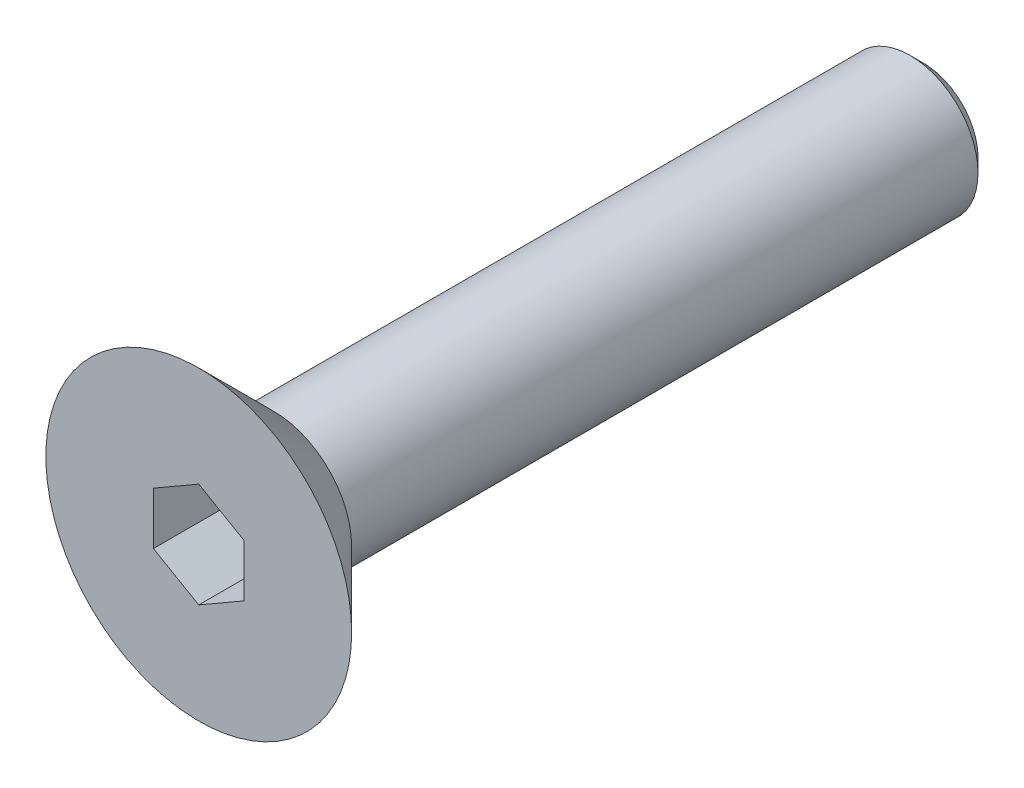
ISO-10303-21;
HEADER;
FILE_DESCRIPTION(('STEP AP214'),'2;1');
FILE_NAME('part.step','',(''),(''),'','','');
FILE_SCHEMA(('AUTOMOTIVE_DESIGN { 1 0 10303 214 1 1 1 1 }'));
ENDSEC;
DATA;
#1=APPLICATION_CONTEXT('core data for automotive mechanical design processes');
#2=APPLICATION_PROTOCOL_DEFINITION('international standard','automotive_design',2000,#1);
#3=PRODUCT_CONTEXT('',#1,'mechanical');
#4=PRODUCT('Part','Part','',(#3));
#5=PRODUCT_RELATED_PRODUCT_CATEGORY('part','',(#4));
#6=PRODUCT_DEFINITION_FORMATION('','',#4);
#7=PRODUCT_DEFINITION_CONTEXT('part definition',#1,'design');
#8=PRODUCT_DEFINITION('design','',#6,#7);
#9=PRODUCT_DEFINITION_SHAPE('','',#8);
#10=(LENGTH_UNIT() NAMED_UNIT(*) SI_UNIT(.MILLI.,.METRE.));
#11=(NAMED_UNIT(*) PLANE_ANGLE_UNIT() SI_UNIT($,.RADIAN.));
#12=(NAMED_UNIT(*) SI_UNIT($,.STERADIAN.) SOLID_ANGLE_UNIT());
#13=UNCERTAINTY_MEASURE_WITH_UNIT(LENGTH_MEASURE(1.E-05),#10,'distance_accuracy_value','');
#14=(GEOMETRIC_REPRESENTATION_CONTEXT(3) GLOBAL_UNCERTAINTY_ASSIGNED_CONTEXT((#13)) GLOBAL_UNIT_ASSIGNED_CONTEXT((#10,
#11,#12)) REPRESENTATION_CONTEXT('',''));
#15=CARTESIAN_POINT('',(0.,0.,0.));
#16=DIRECTION('',(0.,0.,1.));
#17=DIRECTION('',(1.,0.,0.));
#18=AXIS2_PLACEMENT_3D('',#15,#16,#17);
#19=CARTESIAN_POINT('',(0.,0.,0.));
#20=DIRECTION('',(0.,0.,1.));
#21=DIRECTION('',(1.,0.,0.));
#22=AXIS2_PLACEMENT_3D('',#19,#20,#21);
#23=PLANE('',#22);
#24=CARTESIAN_POINT('',(0.,0.,0.));
#25=DIRECTION('',(0.,0.,1.));
#26=DIRECTION('',(1.,0.,0.));
#27=AXIS2_PLACEMENT_3D('',#24,#25,#26);
#28=CIRCLE('',#27,1.725);
#29=CARTESIAN_POINT('',(1.725,0.,0.));
#30=VERTEX_POINT('',#29);
#31=EDGE_CURVE('E11',#30,#30,#28,.F.);
#32=ORIENTED_EDGE('',*,*,#31,.T.);
#33=EDGE_LOOP('',(#32));
#34=FACE_BOUND('',#33,.T.);
#35=CARTESIAN_POINT('',(0.,0.,0.));
#36=DIRECTION('',(0.,0.,1.));
#37=DIRECTION('',(1.,0.,0.));
#38=AXIS2_PLACEMENT_3D('',#35,#36,#37);
#39=CIRCLE('',#38,1.5);
#40=CARTESIAN_POINT('',(1.5,0.,0.));
#41=VERTEX_POINT('',#40);
#42=EDGE_CURVE('E144',#41,#41,#39,.F.);
#43=ORIENTED_EDGE('',*,*,#42,.F.);
#44=EDGE_LOOP('',(#43));
#45=FACE_BOUND('',#44,.T.);
#46=ADVANCED_FACE('F34',(#34,#45),#23,.F.);
#47=CARTESIAN_POINT('',(0.,0.,1.65));
#48=DIRECTION('',(0.,0.,1.));
#49=DIRECTION('',(1.,0.,0.));
#50=AXIS2_PLACEMENT_3D('',#47,#48,#49);
#51=PLANE('',#50);
#52=DIRECTION('',(-0.866025403784439,0.5,0.));
#53=VECTOR('',#52,1.);
#54=CARTESIAN_POINT('',(1.,0.577350269189626,1.65));
#55=LINE('',#54,#53);
#56=CARTESIAN_POINT('',(1.,0.577350269189626,1.65));
#57=VERTEX_POINT('',#56);
#58=CARTESIAN_POINT('',(0.,1.15470053837925,1.65));
#59=VERTEX_POINT('',#58);
#60=EDGE_CURVE('E49',#57,#59,#55,.T.);
#61=ORIENTED_EDGE('',*,*,#60,.F.);
#62=DIRECTION('',(0.,1.,0.));
#63=VECTOR('',#62,1.);
#64=CARTESIAN_POINT('',(1.,-0.577350269189626,1.65));
#65=LINE('',#64,#63);
#66=CARTESIAN_POINT('',(1.,-0.577350269189626,1.65));
#67=VERTEX_POINT('',#66);
#68=EDGE_CURVE('E132',#67,#57,#65,.T.);
#69=ORIENTED_EDGE('',*,*,#68,.F.);
#70=DIRECTION('',(0.866025403784439,0.5,0.));
#71=VECTOR('',#70,1.);
#72=CARTESIAN_POINT('',(0.,-1.15470053837925,1.65));
#73=LINE('',#72,#71);
#74=CARTESIAN_POINT('',(0.,-1.15470053837925,1.65));
#75=VERTEX_POINT('',#74);
#76=EDGE_CURVE('E130',#75,#67,#73,.T.);
#77=ORIENTED_EDGE('',*,*,#76,.F.);
#78=DIRECTION('',(0.866025403784439,-0.5,0.));
#79=VECTOR('',#78,1.);
#80=CARTESIAN_POINT('',(-1.,-0.577350269189626,1.65));
#81=LINE('',#80,#79);
#82=CARTESIAN_POINT('',(-1.,-0.577350269189626,1.65));
#83=VERTEX_POINT('',#82);
#84=EDGE_CURVE('E97',#83,#75,#81,.T.);
#85=ORIENTED_EDGE('',*,*,#84,.F.);
#86=DIRECTION('',(0.,-1.,0.));
#87=VECTOR('',#86,1.);
#88=CARTESIAN_POINT('',(-1.,0.577350269189626,1.65));
#89=LINE('',#88,#87);
#90=CARTESIAN_POINT('',(-1.,0.577350269189626,1.65));
#91=VERTEX_POINT('',#90);
#92=EDGE_CURVE('E126',#91,#83,#89,.T.);
#93=ORIENTED_EDGE('',*,*,#92,.F.);
#94=DIRECTION('',(-0.866025403784439,-0.5,0.));
#95=VECTOR('',#94,1.);
#96=CARTESIAN_POINT('',(0.,1.15470053837925,1.65));
#97=LINE('',#96,#95);
#98=EDGE_CURVE('E123',#59,#91,#97,.T.);
#99=ORIENTED_EDGE('',*,*,#98,.F.);
#100=EDGE_LOOP('',(#61,#69,#77,#85,#93,#99));
#101=FACE_BOUND('',#100,.T.);
#102=CARTESIAN_POINT('',(0.,0.,1.65));
#103=DIRECTION('',(0.,0.,1.));
#104=DIRECTION('',(1.,0.,0.));
#105=AXIS2_PLACEMENT_3D('',#102,#103,#104);
#106=CIRCLE('',#105,3.375);
#107=CARTESIAN_POINT('',(3.37500000000001,0.,1.65));
#108=VERTEX_POINT('',#107);
#109=EDGE_CURVE('E136',#108,#108,#106,.T.);
#110=ORIENTED_EDGE('',*,*,#109,.T.);
#111=EDGE_LOOP('',(#110));
#112=FACE_BOUND('',#111,.T.);
#113=ADVANCED_FACE('F167',(#101,#112),#51,.T.);
#114=CARTESIAN_POINT('',(0.,0.,-14.35));
#115=DIRECTION('',(0.,0.,1.));
#116=DIRECTION('',(1.,0.,0.));
#117=AXIS2_PLACEMENT_3D('',#114,#115,#116);
#118=CYLINDRICAL_SURFACE('',#117,1.5);
#119=CARTESIAN_POINT('',(0.,0.,-14.05));
#120=DIRECTION('',(0.,0.,-1.));
#121=DIRECTION('',(-1.,0.,0.));
#122=AXIS2_PLACEMENT_3D('',#119,#120,#121);
#123=CIRCLE('',#122,1.5);
#124=CARTESIAN_POINT('',(-1.5,0.,-14.05));
#125=VERTEX_POINT('',#124);
#126=EDGE_CURVE('E42',#125,#125,#123,.F.);
#127=ORIENTED_EDGE('',*,*,#126,.T.);
#128=EDGE_LOOP('',(#127));
#129=FACE_BOUND('',#128,.T.);
#130=ORIENTED_EDGE('',*,*,#42,.T.);
#131=EDGE_LOOP('',(#130));
#132=FACE_BOUND('',#131,.T.);
#133=ADVANCED_FACE('F152',(#129,#132),#118,.T.);
#134=CARTESIAN_POINT('',(0.,0.,-14.35));
#135=DIRECTION('',(0.,0.,-1.));
#136=DIRECTION('',(-1.,0.,0.));
#137=AXIS2_PLACEMENT_3D('',#134,#135,#136);
#138=PLANE('',#137);
#139=CARTESIAN_POINT('',(0.,0.,-14.35));
#140=DIRECTION('',(0.,0.,-1.));
#141=DIRECTION('',(-1.,0.,0.));
#142=AXIS2_PLACEMENT_3D('',#139,#140,#141);
#143=CIRCLE('',#142,1.2);
#144=CARTESIAN_POINT('',(-1.2,0.,-14.35));
#145=VERTEX_POINT('',#144);
#146=EDGE_CURVE('E147',#145,#145,#143,.T.);
#147=ORIENTED_EDGE('',*,*,#146,.T.);
#148=EDGE_LOOP('',(#147));
#149=FACE_BOUND('',#148,.T.);
#150=ADVANCED_FACE('F159',(#149),#138,.T.);
#151=CARTESIAN_POINT('',(0.,0.,-14.35));
#152=DIRECTION('',(0.,0.,1.));
#153=DIRECTION('',(1.,0.,0.));
#154=AXIS2_PLACEMENT_3D('',#151,#152,#153);
#155=CONICAL_SURFACE('',#154,1.2,0.785398163397444);
#156=ORIENTED_EDGE('',*,*,#126,.F.);
#157=EDGE_LOOP('',(#156));
#158=FACE_BOUND('',#157,.T.);
#159=ORIENTED_EDGE('',*,*,#146,.F.);
#160=EDGE_LOOP('',(#159));
#161=FACE_BOUND('',#160,.T.);
#162=ADVANCED_FACE('F155',(#158,#161),#155,.T.);
#163=CARTESIAN_POINT('',(1.,0.577350269189626,-0.35));
#164=DIRECTION('',(0.5,0.866025403784439,0.));
#165=DIRECTION('',(-0.866025403784439,0.5,0.));
#166=AXIS2_PLACEMENT_3D('',#163,#164,#165);
#167=PLANE('',#166);
#168=ORIENTED_EDGE('',*,*,#60,.T.);
#169=DIRECTION('',(0.,0.,1.));
#170=VECTOR('',#169,1.);
#171=CARTESIAN_POINT('',(0.,1.15470053837925,-0.35));
#172=LINE('',#171,#170);
#173=CARTESIAN_POINT('',(0.,1.15470053837925,-0.35));
#174=VERTEX_POINT('',#173);
#175=EDGE_CURVE('E79',#174,#59,#172,.T.);
#176=ORIENTED_EDGE('',*,*,#175,.F.);
#177=DIRECTION('',(-0.866025403784439,0.5,0.));
#178=VECTOR('',#177,1.);
#179=CARTESIAN_POINT('',(1.,0.577350269189626,-0.35));
#180=LINE('',#179,#178);
#181=CARTESIAN_POINT('',(1.,0.577350269189626,-0.35));
#182=VERTEX_POINT('',#181);
#183=EDGE_CURVE('E134',#182,#174,#180,.T.);
#184=ORIENTED_EDGE('',*,*,#183,.F.);
#185=DIRECTION('',(0.,0.,1.));
#186=VECTOR('',#185,1.);
#187=CARTESIAN_POINT('',(1.,0.577350269189626,-0.35));
#188=LINE('',#187,#186);
#189=EDGE_CURVE('E57',#182,#57,#188,.T.);
#190=ORIENTED_EDGE('',*,*,#189,.T.);
#191=EDGE_LOOP('',(#168,#176,#184,#190));
#192=FACE_BOUND('',#191,.T.);
#193=ADVANCED_FACE('F158',(#192),#167,.F.);
#194=CARTESIAN_POINT('',(1.,-0.577350269189626,-0.35));
#195=DIRECTION('',(1.,0.,0.));
#196=DIRECTION('',(0.,1.,0.));
#197=AXIS2_PLACEMENT_3D('',#194,#195,#196);
#198=PLANE('',#197);
#199=ORIENTED_EDGE('',*,*,#68,.T.);
#200=ORIENTED_EDGE('',*,*,#189,.F.);
#201=DIRECTION('',(0.,1.,0.));
#202=VECTOR('',#201,1.);
#203=CARTESIAN_POINT('',(1.,-0.577350269189626,-0.35));
#204=LINE('',#203,#202);
#205=CARTESIAN_POINT('',(1.,-0.577350269189626,-0.35));
#206=VERTEX_POINT('',#205);
#207=EDGE_CURVE('E109',#206,#182,#204,.T.);
#208=ORIENTED_EDGE('',*,*,#207,.F.);
#209=DIRECTION('',(0.,0.,1.));
#210=VECTOR('',#209,1.);
#211=CARTESIAN_POINT('',(1.,-0.577350269189626,-0.35));
#212=LINE('',#211,#210);
#213=EDGE_CURVE('E101',#206,#67,#212,.T.);
#214=ORIENTED_EDGE('',*,*,#213,.T.);
#215=EDGE_LOOP('',(#199,#200,#208,#214));
#216=FACE_BOUND('',#215,.T.);
#217=ADVANCED_FACE('F198',(#216),#198,.F.);
#218=CARTESIAN_POINT('',(0.,-1.15470053837925,-0.35));
#219=DIRECTION('',(0.5,-0.866025403784439,0.));
#220=DIRECTION('',(0.866025403784439,0.5,0.));
#221=AXIS2_PLACEMENT_3D('',#218,#219,#220);
#222=PLANE('',#221);
#223=ORIENTED_EDGE('',*,*,#76,.T.);
#224=ORIENTED_EDGE('',*,*,#213,.F.);
#225=DIRECTION('',(0.866025403784439,0.5,0.));
#226=VECTOR('',#225,1.);
#227=CARTESIAN_POINT('',(0.,-1.15470053837925,-0.35));
#228=LINE('',#227,#226);
#229=CARTESIAN_POINT('',(0.,-1.15470053837925,-0.35));
#230=VERTEX_POINT('',#229);
#231=EDGE_CURVE('E105',#230,#206,#228,.T.);
#232=ORIENTED_EDGE('',*,*,#231,.F.);
#233=DIRECTION('',(0.,0.,1.));
#234=VECTOR('',#233,1.);
#235=CARTESIAN_POINT('',(0.,-1.15470053837925,-0.35));
#236=LINE('',#235,#234);
#237=EDGE_CURVE('E90',#230,#75,#236,.T.);
#238=ORIENTED_EDGE('',*,*,#237,.T.);
#239=EDGE_LOOP('',(#223,#224,#232,#238));
#240=FACE_BOUND('',#239,.T.);
#241=ADVANCED_FACE('F106',(#240),#222,.F.);
#242=CARTESIAN_POINT('',(-1.,-0.577350269189626,-0.35));
#243=DIRECTION('',(-0.5,-0.866025403784439,0.));
#244=DIRECTION('',(0.866025403784439,-0.5,0.));
#245=AXIS2_PLACEMENT_3D('',#242,#243,#244);
#246=PLANE('',#245);
#247=ORIENTED_EDGE('',*,*,#84,.T.);
#248=ORIENTED_EDGE('',*,*,#237,.F.);
#249=DIRECTION('',(0.866025403784439,-0.5,0.));
#250=VECTOR('',#249,1.);
#251=CARTESIAN_POINT('',(-1.,-0.577350269189626,-0.35));
#252=LINE('',#251,#250);
#253=CARTESIAN_POINT('',(-1.,-0.577350269189626,-0.35));
#254=VERTEX_POINT('',#253);
#255=EDGE_CURVE('E94',#254,#230,#252,.T.);
#256=ORIENTED_EDGE('',*,*,#255,.F.);
#257=DIRECTION('',(0.,0.,1.));
#258=VECTOR('',#257,1.);
#259=CARTESIAN_POINT('',(-1.,-0.577350269189626,-0.35));
#260=LINE('',#259,#258);
#261=EDGE_CURVE('E102',#254,#83,#260,.T.);
#262=ORIENTED_EDGE('',*,*,#261,.T.);
#263=EDGE_LOOP('',(#247,#248,#256,#262));
#264=FACE_BOUND('',#263,.T.);
#265=ADVANCED_FACE('F92',(#264),#246,.F.);
#266=CARTESIAN_POINT('',(-1.,0.577350269189626,-0.35));
#267=DIRECTION('',(-1.,0.,0.));
#268=DIRECTION('',(0.,-1.,0.));
#269=AXIS2_PLACEMENT_3D('',#266,#267,#268);
#270=PLANE('',#269);
#271=ORIENTED_EDGE('',*,*,#92,.T.);
#272=ORIENTED_EDGE('',*,*,#261,.F.);
#273=DIRECTION('',(0.,-1.,0.));
#274=VECTOR('',#273,1.);
#275=CARTESIAN_POINT('',(-1.,0.577350269189626,-0.35));
#276=LINE('',#275,#274);
#277=CARTESIAN_POINT('',(-1.,0.577350269189626,-0.35));
#278=VERTEX_POINT('',#277);
#279=EDGE_CURVE('E115',#278,#254,#276,.T.);
#280=ORIENTED_EDGE('',*,*,#279,.F.);
#281=DIRECTION('',(0.,0.,1.));
#282=VECTOR('',#281,1.);
#283=CARTESIAN_POINT('',(-1.,0.577350269189626,-0.35));
#284=LINE('',#283,#282);
#285=EDGE_CURVE('E139',#278,#91,#284,.T.);
#286=ORIENTED_EDGE('',*,*,#285,.T.);
#287=EDGE_LOOP('',(#271,#272,#280,#286));
#288=FACE_BOUND('',#287,.T.);
#289=ADVANCED_FACE('F194',(#288),#270,.F.);
#290=CARTESIAN_POINT('',(0.,1.15470053837925,-0.35));
#291=DIRECTION('',(-0.5,0.866025403784439,0.));
#292=DIRECTION('',(-0.866025403784439,-0.5,0.));
#293=AXIS2_PLACEMENT_3D('',#290,#291,#292);
#294=PLANE('',#293);
#295=ORIENTED_EDGE('',*,*,#98,.T.);
#296=ORIENTED_EDGE('',*,*,#285,.F.);
#297=DIRECTION('',(-0.866025403784439,-0.5,0.));
#298=VECTOR('',#297,1.);
#299=CARTESIAN_POINT('',(0.,1.15470053837925,-0.35));
#300=LINE('',#299,#298);
#301=EDGE_CURVE('E117',#174,#278,#300,.T.);
#302=ORIENTED_EDGE('',*,*,#301,.F.);
#303=ORIENTED_EDGE('',*,*,#175,.T.);
#304=EDGE_LOOP('',(#295,#296,#302,#303));
#305=FACE_BOUND('',#304,.T.);
#306=ADVANCED_FACE('F189',(#305),#294,.F.);
#307=CARTESIAN_POINT('',(0.,0.,-0.35));
#308=DIRECTION('',(0.,0.,1.));
#309=DIRECTION('',(1.,0.,0.));
#310=AXIS2_PLACEMENT_3D('',#307,#308,#309);
#311=PLANE('',#310);
#312=ORIENTED_EDGE('',*,*,#183,.T.);
#313=ORIENTED_EDGE('',*,*,#301,.T.);
#314=ORIENTED_EDGE('',*,*,#279,.T.);
#315=ORIENTED_EDGE('',*,*,#255,.T.);
#316=ORIENTED_EDGE('',*,*,#231,.T.);
#317=ORIENTED_EDGE('',*,*,#207,.T.);
#318=EDGE_LOOP('',(#312,#313,#314,#315,#316,#317));
#319=FACE_BOUND('',#318,.T.);
#320=ADVANCED_FACE('F112',(#319),#311,.T.);
#321=CARTESIAN_POINT('',(0.,0.,1.64999999999999));
#322=DIRECTION('',(0.,0.,1.));
#323=DIRECTION('',(1.,0.,0.));
#324=AXIS2_PLACEMENT_3D('',#321,#322,#323);
#325=CONICAL_SURFACE('',#324,3.375,0.78539816339745);
#326=CARTESIAN_POINT('',(1.725,0.,0.));
#327=CARTESIAN_POINT('',(1.7421875,0.,0.0171874999999997));
#328=CARTESIAN_POINT('',(1.759375,0.,0.0343749999999997));
#329=CARTESIAN_POINT('',(1.79375,0.,0.0687499999999997));
#330=CARTESIAN_POINT('',(1.8109375,0.,0.0859374999999997));
#331=CARTESIAN_POINT('',(1.8453125,0.,0.1203125));
#332=CARTESIAN_POINT('',(1.8625,0.,0.1375));
#333=CARTESIAN_POINT('',(1.896875,0.,0.171875));
#334=CARTESIAN_POINT('',(1.9140625,0.,0.1890625));
#335=CARTESIAN_POINT('',(1.9484375,0.,0.2234375));
#336=CARTESIAN_POINT('',(1.965625,0.,0.240625));
#337=CARTESIAN_POINT('',(2.,0.,0.275));
#338=CARTESIAN_POINT('',(2.0171875,0.,0.2921875));
#339=CARTESIAN_POINT('',(2.0515625,0.,0.3265625));
#340=CARTESIAN_POINT('',(2.06875,0.,0.34375));
#341=CARTESIAN_POINT('',(2.103125,0.,0.378125));
#342=CARTESIAN_POINT('',(2.1203125,0.,0.3953125));
#343=CARTESIAN_POINT('',(2.1546875,0.,0.4296875));
#344=CARTESIAN_POINT('',(2.171875,0.,0.446875));
#345=CARTESIAN_POINT('',(2.20625,0.,0.48125));
#346=CARTESIAN_POINT('',(2.2234375,0.,0.4984375));
#347=CARTESIAN_POINT('',(2.2578125,0.,0.5328125));
#348=CARTESIAN_POINT('',(2.275,0.,0.55));
#349=CARTESIAN_POINT('',(2.309375,0.,0.584375));
#350=CARTESIAN_POINT('',(2.3265625,0.,0.6015625));
#351=CARTESIAN_POINT('',(2.3609375,0.,0.6359375));
#352=CARTESIAN_POINT('',(2.378125,0.,0.653125));
#353=CARTESIAN_POINT('',(2.4125,0.,0.6875));
#354=CARTESIAN_POINT('',(2.4296875,0.,0.7046875));
#355=CARTESIAN_POINT('',(2.4640625,0.,0.7390625));
#356=CARTESIAN_POINT('',(2.48125,0.,0.75625));
#357=CARTESIAN_POINT('',(2.515625,0.,0.790625));
#358=CARTESIAN_POINT('',(2.5328125,0.,0.8078125));
#359=CARTESIAN_POINT('',(2.5671875,0.,0.8421875));
#360=CARTESIAN_POINT('',(2.584375,0.,0.859375));
#361=CARTESIAN_POINT('',(2.61875,0.,0.89375));
#362=CARTESIAN_POINT('',(2.6359375,0.,0.9109375));
#363=CARTESIAN_POINT('',(2.6703125,0.,0.9453125));
#364=CARTESIAN_POINT('',(2.6875,0.,0.9625));
#365=CARTESIAN_POINT('',(2.721875,0.,0.996875));
#366=CARTESIAN_POINT('',(2.7390625,0.,1.0140625));
#367=CARTESIAN_POINT('',(2.7734375,0.,1.0484375));
#368=CARTESIAN_POINT('',(2.790625,0.,1.065625));
#369=CARTESIAN_POINT('',(2.825,0.,1.1));
#370=CARTESIAN_POINT('',(2.8421875,0.,1.1171875));
#371=CARTESIAN_POINT('',(2.8765625,0.,1.1515625));
#372=CARTESIAN_POINT('',(2.89375,0.,1.16875));
#373=CARTESIAN_POINT('',(2.928125,0.,1.203125));
#374=CARTESIAN_POINT('',(2.9453125,0.,1.2203125));
#375=CARTESIAN_POINT('',(2.9796875,0.,1.2546875));
#376=CARTESIAN_POINT('',(2.996875,0.,1.271875));
#377=CARTESIAN_POINT('',(3.03125,0.,1.30625));
#378=CARTESIAN_POINT('',(3.0484375,0.,1.3234375));
#379=CARTESIAN_POINT('',(3.0828125,0.,1.3578125));
#380=CARTESIAN_POINT('',(3.1,0.,1.375));
#381=CARTESIAN_POINT('',(3.134375,0.,1.409375));
#382=CARTESIAN_POINT('',(3.1515625,0.,1.4265625));
#383=CARTESIAN_POINT('',(3.1859375,0.,1.4609375));
#384=CARTESIAN_POINT('',(3.203125,0.,1.478125));
#385=CARTESIAN_POINT('',(3.2375,0.,1.5125));
#386=CARTESIAN_POINT('',(3.2546875,0.,1.5296875));
#387=CARTESIAN_POINT('',(3.2890625,0.,1.5640625));
#388=CARTESIAN_POINT('',(3.30625,0.,1.58125));
#389=CARTESIAN_POINT('',(3.34062500000001,0.,1.615625));
#390=CARTESIAN_POINT('',(3.3578125,0.,1.6328125));
#391=CARTESIAN_POINT('',(3.37500000000001,0.,1.65));
#392=B_SPLINE_CURVE_WITH_KNOTS('',3,(#326,#327,#328,#329,#330,#331,#332,#333,#334,#335,#336,
#337,#338,#339,#340,#341,#342,#343,#344,#345,#346,#347,#348,#349,#350,#351,#352,#353,#354,#355,
#356,#357,#358,#359,#360,#361,#362,#363,#364,#365,#366,#367,#368,#369,#370,#371,#372,#373,#374,
#375,#376,#377,#378,#379,#380,#381,#382,#383,#384,#385,#386,#387,#388,#389,#390,#391),
.UNSPECIFIED.,.F.,.F.,(4,2,2,2,2,2,2,2,2,2,2,2,2,2,2,2,2,2,2,2,2,2,2,2,2,2,2,2,2,2,2,2,4),(0.,
0.0729203868098628,0.145840773619725,0.218761160429589,0.291681547239451,0.364601934049314,
0.437522320859177,0.51044270766904,0.583363094478903,0.656283481288766,0.729203868098629,
0.802124254908491,0.875044641718354,0.947965028528217,1.02088541533808,1.09380580214794,
1.16672618895781,1.23964657576767,1.31256696257753,1.38548734938739,1.45840773619726,
1.53132812300712,1.60424850981698,1.67716889662685,1.75008928343671,1.82300967024657,
1.89593005705643,1.9688504438663,2.04177083067616,2.11469121748602,2.18761160429589,
2.26053199110575,2.33345237791561),.UNSPECIFIED.);
#393=EDGE_CURVE('BSEAM36',#30,#108,#392,.T.);
#394=ORIENTED_EDGE('',*,*,#31,.F.);
#395=ORIENTED_EDGE('',*,*,#109,.F.);
#396=ORIENTED_EDGE('',*,*,#393,.T.);
#397=ORIENTED_EDGE('',*,*,#393,.F.);
#398=EDGE_LOOP('',(#394,#396,#395,#397));
#399=FACE_BOUND('',#398,.T.);
#400=ADVANCED_FACE('F36',(#399),#325,.T.);
#401=CLOSED_SHELL('',(#46,#113,#133,#150,#162,#193,#217,#241,#265,#289,#306,#320,#400));
#402=MANIFOLD_SOLID_BREP('B2',#401);
#403=ADVANCED_BREP_SHAPE_REPRESENTATION('',(#18,#402),#14);
#404=SHAPE_DEFINITION_REPRESENTATION(#9,#403);
ENDSEC;
END-ISO-10303-21;
